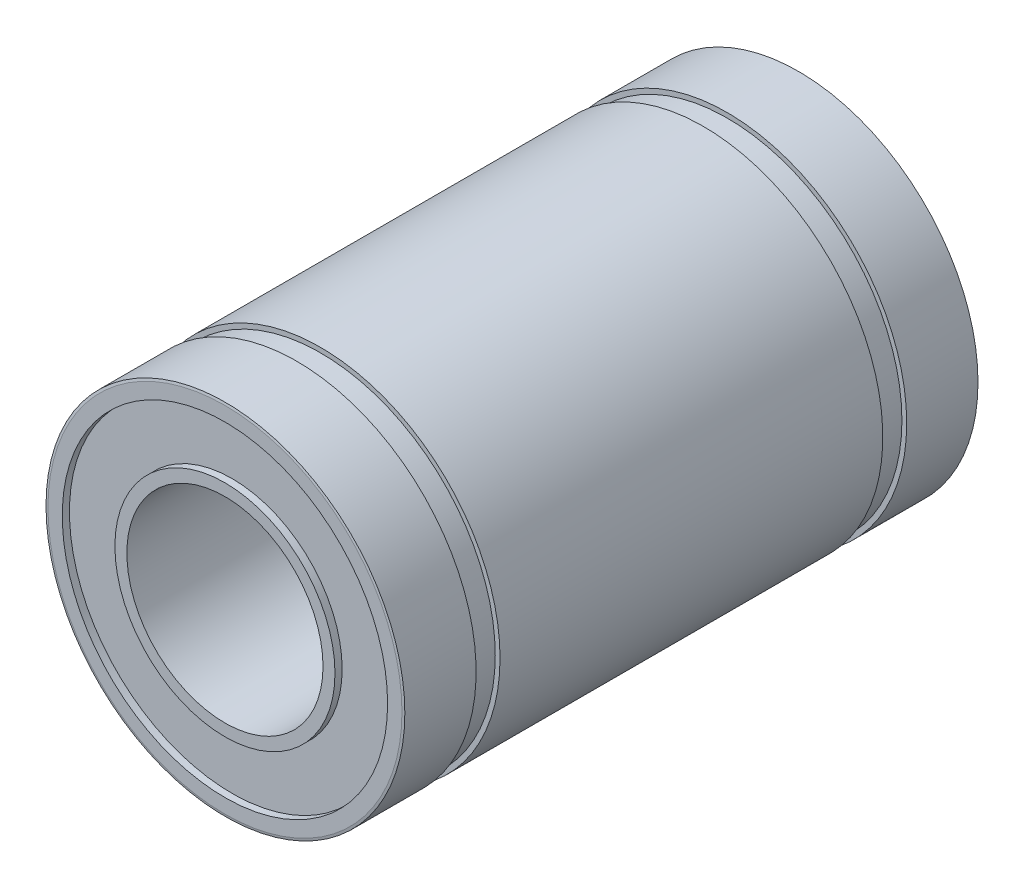
ISO-10303-21;
HEADER;
FILE_DESCRIPTION(('STEP AP214'),'2;1');
FILE_NAME('part.step','',(''),(''),'','','');
FILE_SCHEMA(('AUTOMOTIVE_DESIGN { 1 0 10303 214 1 1 1 1 }'));
ENDSEC;
DATA;
#1=APPLICATION_CONTEXT('core data for automotive mechanical design processes');
#2=APPLICATION_PROTOCOL_DEFINITION('international standard','automotive_design',2000,#1);
#3=PRODUCT_CONTEXT('',#1,'mechanical');
#4=PRODUCT('Part','Part','',(#3));
#5=PRODUCT_RELATED_PRODUCT_CATEGORY('part','',(#4));
#6=PRODUCT_DEFINITION_FORMATION('','',#4);
#7=PRODUCT_DEFINITION_CONTEXT('part definition',#1,'design');
#8=PRODUCT_DEFINITION('design','',#6,#7);
#9=PRODUCT_DEFINITION_SHAPE('','',#8);
#10=(LENGTH_UNIT() NAMED_UNIT(*) SI_UNIT(.MILLI.,.METRE.));
#11=(NAMED_UNIT(*) PLANE_ANGLE_UNIT() SI_UNIT($,.RADIAN.));
#12=(NAMED_UNIT(*) SI_UNIT($,.STERADIAN.) SOLID_ANGLE_UNIT());
#13=UNCERTAINTY_MEASURE_WITH_UNIT(LENGTH_MEASURE(1.E-05),#10,'distance_accuracy_value','');
#14=(GEOMETRIC_REPRESENTATION_CONTEXT(3) GLOBAL_UNCERTAINTY_ASSIGNED_CONTEXT((#13)) GLOBAL_UNIT_ASSIGNED_CONTEXT((#10,
#11,#12)) REPRESENTATION_CONTEXT('',''));
#15=CARTESIAN_POINT('',(0.,0.,0.));
#16=DIRECTION('',(0.,0.,1.));
#17=DIRECTION('',(1.,0.,0.));
#18=AXIS2_PLACEMENT_3D('',#15,#16,#17);
#19=CARTESIAN_POINT('',(0.,0.,24.));
#20=DIRECTION('',(0.,0.,-1.));
#21=DIRECTION('',(-1.,0.,0.));
#22=AXIS2_PLACEMENT_3D('',#19,#20,#21);
#23=CYLINDRICAL_SURFACE('',#22,7.5);
#24=CARTESIAN_POINT('',(0.,0.,23.98));
#25=DIRECTION('',(0.,0.,1.));
#26=DIRECTION('',(1.,0.,0.));
#27=AXIS2_PLACEMENT_3D('',#24,#25,#26);
#28=CIRCLE('',#27,7.5);
#29=CARTESIAN_POINT('',(7.5,0.,23.98));
#30=VERTEX_POINT('',#29);
#31=EDGE_CURVE('E73',#30,#30,#28,.T.);
#32=ORIENTED_EDGE('',*,*,#31,.F.);
#33=EDGE_LOOP('',(#32));
#34=FACE_BOUND('',#33,.T.);
#35=CARTESIAN_POINT('',(0.,0.,21.));
#36=DIRECTION('',(0.,0.,-1.));
#37=DIRECTION('',(-1.,0.,0.));
#38=AXIS2_PLACEMENT_3D('',#35,#36,#37);
#39=CIRCLE('',#38,7.5);
#40=CARTESIAN_POINT('',(-7.5,0.,21.));
#41=VERTEX_POINT('',#40);
#42=EDGE_CURVE('E19',#41,#41,#39,.T.);
#43=ORIENTED_EDGE('',*,*,#42,.F.);
#44=EDGE_LOOP('',(#43));
#45=FACE_BOUND('',#44,.T.);
#46=ADVANCED_FACE('F15',(#34,#45),#23,.T.);
#47=CARTESIAN_POINT('',(0.,0.,4.));
#48=DIRECTION('',(0.,0.,-1.));
#49=DIRECTION('',(-1.,0.,0.));
#50=AXIS2_PLACEMENT_3D('',#47,#48,#49);
#51=CIRCLE('',#50,7.5);
#52=CARTESIAN_POINT('',(-7.5,0.,4.));
#53=VERTEX_POINT('',#52);
#54=EDGE_CURVE('E33',#53,#53,#51,.T.);
#55=ORIENTED_EDGE('',*,*,#54,.F.);
#56=EDGE_LOOP('',(#55));
#57=FACE_BOUND('',#56,.T.);
#58=CARTESIAN_POINT('',(0.,0.,20.));
#59=DIRECTION('',(0.,0.,1.));
#60=DIRECTION('',(1.,0.,0.));
#61=AXIS2_PLACEMENT_3D('',#58,#59,#60);
#62=CIRCLE('',#61,7.5);
#63=CARTESIAN_POINT('',(7.5,0.,20.));
#64=VERTEX_POINT('',#63);
#65=EDGE_CURVE('E40',#64,#64,#62,.T.);
#66=ORIENTED_EDGE('',*,*,#65,.F.);
#67=EDGE_LOOP('',(#66));
#68=FACE_BOUND('',#67,.T.);
#69=ADVANCED_FACE('F114',(#57,#68),#23,.T.);
#70=CARTESIAN_POINT('',(0.,0.,0.0199999999999992));
#71=DIRECTION('',(0.,0.,1.));
#72=DIRECTION('',(1.,0.,0.));
#73=AXIS2_PLACEMENT_3D('',#70,#71,#72);
#74=CIRCLE('',#73,7.5);
#75=CARTESIAN_POINT('',(7.5,0.,0.0199999999999992));
#76=VERTEX_POINT('',#75);
#77=EDGE_CURVE('E28',#76,#76,#74,.T.);
#78=ORIENTED_EDGE('',*,*,#77,.T.);
#79=EDGE_LOOP('',(#78));
#80=FACE_BOUND('',#79,.T.);
#81=CARTESIAN_POINT('',(0.,0.,3.));
#82=DIRECTION('',(0.,0.,1.));
#83=DIRECTION('',(1.,0.,0.));
#84=AXIS2_PLACEMENT_3D('',#81,#82,#83);
#85=CIRCLE('',#84,7.5);
#86=CARTESIAN_POINT('',(7.5,0.,3.));
#87=VERTEX_POINT('',#86);
#88=EDGE_CURVE('E36',#87,#87,#85,.T.);
#89=ORIENTED_EDGE('',*,*,#88,.F.);
#90=EDGE_LOOP('',(#89));
#91=FACE_BOUND('',#90,.T.);
#92=ADVANCED_FACE('F17',(#80,#91),#23,.T.);
#93=CARTESIAN_POINT('',(0.,0.,24.));
#94=DIRECTION('',(0.,0.,1.));
#95=DIRECTION('',(1.,0.,0.));
#96=AXIS2_PLACEMENT_3D('',#93,#94,#95);
#97=PLANE('',#96);
#98=CARTESIAN_POINT('',(0.,0.,24.));
#99=DIRECTION('',(0.,0.,1.));
#100=DIRECTION('',(1.,0.,0.));
#101=AXIS2_PLACEMENT_3D('',#98,#99,#100);
#102=CIRCLE('',#101,4.1);
#103=CARTESIAN_POINT('',(4.1,0.,24.));
#104=VERTEX_POINT('',#103);
#105=EDGE_CURVE('E10',#104,#104,#102,.T.);
#106=ORIENTED_EDGE('',*,*,#105,.F.);
#107=EDGE_LOOP('',(#106));
#108=FACE_BOUND('',#107,.T.);
#109=CARTESIAN_POINT('',(0.,0.,24.));
#110=DIRECTION('',(0.,0.,1.));
#111=DIRECTION('',(1.,0.,0.));
#112=AXIS2_PLACEMENT_3D('',#109,#110,#111);
#113=CIRCLE('',#112,4.6);
#114=CARTESIAN_POINT('',(4.6,0.,24.));
#115=VERTEX_POINT('',#114);
#116=EDGE_CURVE('E39',#115,#115,#113,.T.);
#117=ORIENTED_EDGE('',*,*,#116,.T.);
#118=EDGE_LOOP('',(#117));
#119=FACE_BOUND('',#118,.T.);
#120=ADVANCED_FACE('F124',(#108,#119),#97,.T.);
#121=CARTESIAN_POINT('',(0.,0.,0.));
#122=DIRECTION('',(0.,0.,1.));
#123=DIRECTION('',(1.,0.,0.));
#124=AXIS2_PLACEMENT_3D('',#121,#122,#123);
#125=PLANE('',#124);
#126=CARTESIAN_POINT('',(0.,0.,0.));
#127=DIRECTION('',(0.,0.,1.));
#128=DIRECTION('',(1.,0.,0.));
#129=AXIS2_PLACEMENT_3D('',#126,#127,#128);
#130=CIRCLE('',#129,4.1);
#131=CARTESIAN_POINT('',(4.1,0.,0.));
#132=VERTEX_POINT('',#131);
#133=EDGE_CURVE('E23',#132,#132,#130,.T.);
#134=ORIENTED_EDGE('',*,*,#133,.T.);
#135=EDGE_LOOP('',(#134));
#136=FACE_BOUND('',#135,.T.);
#137=CARTESIAN_POINT('',(0.,0.,0.));
#138=DIRECTION('',(0.,0.,1.));
#139=DIRECTION('',(1.,0.,0.));
#140=AXIS2_PLACEMENT_3D('',#137,#138,#139);
#141=CIRCLE('',#140,4.6);
#142=CARTESIAN_POINT('',(4.6,0.,0.));
#143=VERTEX_POINT('',#142);
#144=EDGE_CURVE('E76',#143,#143,#141,.T.);
#145=ORIENTED_EDGE('',*,*,#144,.F.);
#146=EDGE_LOOP('',(#145));
#147=FACE_BOUND('',#146,.T.);
#148=ADVANCED_FACE('F111',(#136,#147),#125,.F.);
#149=CARTESIAN_POINT('',(0.,0.,24.));
#150=DIRECTION('',(0.,0.,-1.));
#151=DIRECTION('',(-1.,0.,0.));
#152=AXIS2_PLACEMENT_3D('',#149,#150,#151);
#153=CYLINDRICAL_SURFACE('',#152,4.1);
#154=ORIENTED_EDGE('',*,*,#105,.T.);
#155=EDGE_LOOP('',(#154));
#156=FACE_BOUND('',#155,.T.);
#157=ORIENTED_EDGE('',*,*,#133,.F.);
#158=EDGE_LOOP('',(#157));
#159=FACE_BOUND('',#158,.T.);
#160=ADVANCED_FACE('F99',(#156,#159),#153,.F.);
#161=CARTESIAN_POINT('',(0.,0.,0.0199999999999992));
#162=DIRECTION('',(0.,0.,1.));
#163=DIRECTION('',(1.,0.,0.));
#164=AXIS2_PLACEMENT_3D('',#161,#162,#163);
#165=CONICAL_SURFACE('',#164,7.5,1.37340076694502);
#166=CARTESIAN_POINT('',(0.,0.,0.));
#167=DIRECTION('',(0.,0.,1.));
#168=DIRECTION('',(1.,0.,0.));
#169=AXIS2_PLACEMENT_3D('',#166,#167,#168);
#170=CIRCLE('',#169,7.4);
#171=CARTESIAN_POINT('',(7.4,0.,0.));
#172=VERTEX_POINT('',#171);
#173=EDGE_CURVE('E87',#172,#172,#170,.T.);
#174=ORIENTED_EDGE('',*,*,#173,.T.);
#175=EDGE_LOOP('',(#174));
#176=FACE_BOUND('',#175,.T.);
#177=ORIENTED_EDGE('',*,*,#77,.F.);
#178=EDGE_LOOP('',(#177));
#179=FACE_BOUND('',#178,.T.);
#180=ADVANCED_FACE('F96',(#176,#179),#165,.T.);
#181=CARTESIAN_POINT('',(0.,0.,24.));
#182=DIRECTION('',(0.,0.,1.));
#183=DIRECTION('',(1.,0.,0.));
#184=AXIS2_PLACEMENT_3D('',#181,#182,#183);
#185=CYLINDRICAL_SURFACE('',#184,6.8);
#186=CARTESIAN_POINT('',(0.,0.,0.3));
#187=DIRECTION('',(0.,0.,1.));
#188=DIRECTION('',(1.,0.,0.));
#189=AXIS2_PLACEMENT_3D('',#186,#187,#188);
#190=CIRCLE('',#189,6.8);
#191=CARTESIAN_POINT('',(6.8,0.,0.3));
#192=VERTEX_POINT('',#191);
#193=EDGE_CURVE('E82',#192,#192,#190,.T.);
#194=ORIENTED_EDGE('',*,*,#193,.T.);
#195=EDGE_LOOP('',(#194));
#196=FACE_BOUND('',#195,.T.);
#197=CARTESIAN_POINT('',(0.,0.,0.));
#198=DIRECTION('',(0.,0.,1.));
#199=DIRECTION('',(1.,0.,0.));
#200=AXIS2_PLACEMENT_3D('',#197,#198,#199);
#201=CIRCLE('',#200,6.8);
#202=CARTESIAN_POINT('',(6.8,0.,0.));
#203=VERTEX_POINT('',#202);
#204=EDGE_CURVE('E85',#203,#203,#201,.T.);
#205=ORIENTED_EDGE('',*,*,#204,.F.);
#206=EDGE_LOOP('',(#205));
#207=FACE_BOUND('',#206,.T.);
#208=ADVANCED_FACE('F98',(#196,#207),#185,.F.);
#209=CARTESIAN_POINT('',(-6.8,0.,0.3));
#210=DIRECTION('',(0.,0.,-1.));
#211=DIRECTION('',(-1.,0.,0.));
#212=AXIS2_PLACEMENT_3D('',#209,#210,#211);
#213=PLANE('',#212);
#214=CARTESIAN_POINT('',(0.,0.,0.3));
#215=DIRECTION('',(0.,0.,1.));
#216=DIRECTION('',(1.,0.,0.));
#217=AXIS2_PLACEMENT_3D('',#214,#215,#216);
#218=CIRCLE('',#217,4.6);
#219=CARTESIAN_POINT('',(4.6,0.,0.3));
#220=VERTEX_POINT('',#219);
#221=EDGE_CURVE('E79',#220,#220,#218,.T.);
#222=ORIENTED_EDGE('',*,*,#221,.T.);
#223=EDGE_LOOP('',(#222));
#224=FACE_BOUND('',#223,.T.);
#225=ORIENTED_EDGE('',*,*,#193,.F.);
#226=EDGE_LOOP('',(#225));
#227=FACE_BOUND('',#226,.T.);
#228=ADVANCED_FACE('F107',(#224,#227),#213,.T.);
#229=CARTESIAN_POINT('',(0.,0.,24.));
#230=DIRECTION('',(0.,0.,1.));
#231=DIRECTION('',(1.,0.,0.));
#232=AXIS2_PLACEMENT_3D('',#229,#230,#231);
#233=CYLINDRICAL_SURFACE('',#232,4.6);
#234=ORIENTED_EDGE('',*,*,#144,.T.);
#235=EDGE_LOOP('',(#234));
#236=FACE_BOUND('',#235,.T.);
#237=ORIENTED_EDGE('',*,*,#221,.F.);
#238=EDGE_LOOP('',(#237));
#239=FACE_BOUND('',#238,.T.);
#240=ADVANCED_FACE('F178',(#236,#239),#233,.T.);
#241=ORIENTED_EDGE('',*,*,#204,.T.);
#242=EDGE_LOOP('',(#241));
#243=FACE_BOUND('',#242,.T.);
#244=ORIENTED_EDGE('',*,*,#173,.F.);
#245=EDGE_LOOP('',(#244));
#246=FACE_BOUND('',#245,.T.);
#247=ADVANCED_FACE('F138',(#243,#246),#125,.F.);
#248=CARTESIAN_POINT('',(0.,0.,24.));
#249=DIRECTION('',(0.,0.,1.));
#250=DIRECTION('',(1.,0.,0.));
#251=AXIS2_PLACEMENT_3D('',#248,#249,#250);
#252=CYLINDRICAL_SURFACE('',#251,6.8);
#253=CARTESIAN_POINT('',(0.,0.,24.));
#254=DIRECTION('',(0.,0.,1.));
#255=DIRECTION('',(1.,0.,0.));
#256=AXIS2_PLACEMENT_3D('',#253,#254,#255);
#257=CIRCLE('',#256,6.8);
#258=CARTESIAN_POINT('',(6.8,0.,24.));
#259=VERTEX_POINT('',#258);
#260=EDGE_CURVE('E67',#259,#259,#257,.T.);
#261=ORIENTED_EDGE('',*,*,#260,.T.);
#262=EDGE_LOOP('',(#261));
#263=FACE_BOUND('',#262,.T.);
#264=CARTESIAN_POINT('',(0.,0.,23.7));
#265=DIRECTION('',(0.,0.,1.));
#266=DIRECTION('',(1.,0.,0.));
#267=AXIS2_PLACEMENT_3D('',#264,#265,#266);
#268=CIRCLE('',#267,6.8);
#269=CARTESIAN_POINT('',(6.8,0.,23.7));
#270=VERTEX_POINT('',#269);
#271=EDGE_CURVE('E64',#270,#270,#268,.T.);
#272=ORIENTED_EDGE('',*,*,#271,.F.);
#273=EDGE_LOOP('',(#272));
#274=FACE_BOUND('',#273,.T.);
#275=ADVANCED_FACE('F161',(#263,#274),#252,.F.);
#276=CARTESIAN_POINT('',(-6.8,0.,23.7));
#277=DIRECTION('',(0.,0.,1.));
#278=DIRECTION('',(1.,0.,0.));
#279=AXIS2_PLACEMENT_3D('',#276,#277,#278);
#280=PLANE('',#279);
#281=ORIENTED_EDGE('',*,*,#271,.T.);
#282=EDGE_LOOP('',(#281));
#283=FACE_BOUND('',#282,.T.);
#284=CARTESIAN_POINT('',(0.,0.,23.7));
#285=DIRECTION('',(0.,0.,1.));
#286=DIRECTION('',(1.,0.,0.));
#287=AXIS2_PLACEMENT_3D('',#284,#285,#286);
#288=CIRCLE('',#287,4.6);
#289=CARTESIAN_POINT('',(4.6,0.,23.7));
#290=VERTEX_POINT('',#289);
#291=EDGE_CURVE('E61',#290,#290,#288,.T.);
#292=ORIENTED_EDGE('',*,*,#291,.F.);
#293=EDGE_LOOP('',(#292));
#294=FACE_BOUND('',#293,.T.);
#295=ADVANCED_FACE('F153',(#283,#294),#280,.T.);
#296=CARTESIAN_POINT('',(0.,0.,24.));
#297=DIRECTION('',(0.,0.,1.));
#298=DIRECTION('',(1.,0.,0.));
#299=AXIS2_PLACEMENT_3D('',#296,#297,#298);
#300=CYLINDRICAL_SURFACE('',#299,4.6);
#301=ORIENTED_EDGE('',*,*,#291,.T.);
#302=EDGE_LOOP('',(#301));
#303=FACE_BOUND('',#302,.T.);
#304=ORIENTED_EDGE('',*,*,#116,.F.);
#305=EDGE_LOOP('',(#304));
#306=FACE_BOUND('',#305,.T.);
#307=ADVANCED_FACE('F142',(#303,#306),#300,.T.);
#308=ORIENTED_EDGE('',*,*,#260,.F.);
#309=EDGE_LOOP('',(#308));
#310=FACE_BOUND('',#309,.T.);
#311=CARTESIAN_POINT('',(0.,0.,24.));
#312=DIRECTION('',(0.,0.,1.));
#313=DIRECTION('',(1.,0.,0.));
#314=AXIS2_PLACEMENT_3D('',#311,#312,#313);
#315=CIRCLE('',#314,7.4);
#316=CARTESIAN_POINT('',(7.4,0.,24.));
#317=VERTEX_POINT('',#316);
#318=EDGE_CURVE('E70',#317,#317,#315,.T.);
#319=ORIENTED_EDGE('',*,*,#318,.T.);
#320=EDGE_LOOP('',(#319));
#321=FACE_BOUND('',#320,.T.);
#322=ADVANCED_FACE('F132',(#310,#321),#97,.T.);
#323=CARTESIAN_POINT('',(0.,0.,24.));
#324=DIRECTION('',(0.,0.,-1.));
#325=DIRECTION('',(-1.,0.,0.));
#326=AXIS2_PLACEMENT_3D('',#323,#324,#325);
#327=CONICAL_SURFACE('',#326,7.4,1.37340076694502);
#328=ORIENTED_EDGE('',*,*,#31,.T.);
#329=EDGE_LOOP('',(#328));
#330=FACE_BOUND('',#329,.T.);
#331=ORIENTED_EDGE('',*,*,#318,.F.);
#332=EDGE_LOOP('',(#331));
#333=FACE_BOUND('',#332,.T.);
#334=ADVANCED_FACE('F141',(#330,#333),#327,.T.);
#335=CARTESIAN_POINT('',(-7.7,0.,3.));
#336=DIRECTION('',(0.,0.,1.));
#337=DIRECTION('',(1.,0.,0.));
#338=AXIS2_PLACEMENT_3D('',#335,#336,#337);
#339=PLANE('',#338);
#340=CARTESIAN_POINT('',(0.,0.,3.));
#341=DIRECTION('',(0.,0.,1.));
#342=DIRECTION('',(1.,0.,0.));
#343=AXIS2_PLACEMENT_3D('',#340,#341,#342);
#344=CIRCLE('',#343,7.3);
#345=CARTESIAN_POINT('',(7.3,0.,3.));
#346=VERTEX_POINT('',#345);
#347=EDGE_CURVE('E37',#346,#346,#344,.T.);
#348=ORIENTED_EDGE('',*,*,#347,.F.);
#349=EDGE_LOOP('',(#348));
#350=FACE_BOUND('',#349,.T.);
#351=ORIENTED_EDGE('',*,*,#88,.T.);
#352=EDGE_LOOP('',(#351));
#353=FACE_BOUND('',#352,.T.);
#354=ADVANCED_FACE('F149',(#350,#353),#339,.T.);
#355=CARTESIAN_POINT('',(-7.7,0.,4.));
#356=DIRECTION('',(0.,0.,-1.));
#357=DIRECTION('',(-1.,0.,0.));
#358=AXIS2_PLACEMENT_3D('',#355,#356,#357);
#359=PLANE('',#358);
#360=CARTESIAN_POINT('',(0.,0.,4.));
#361=DIRECTION('',(0.,0.,1.));
#362=DIRECTION('',(1.,0.,0.));
#363=AXIS2_PLACEMENT_3D('',#360,#361,#362);
#364=CIRCLE('',#363,7.3);
#365=CARTESIAN_POINT('',(7.3,0.,4.));
#366=VERTEX_POINT('',#365);
#367=EDGE_CURVE('E46',#366,#366,#364,.T.);
#368=ORIENTED_EDGE('',*,*,#367,.T.);
#369=EDGE_LOOP('',(#368));
#370=FACE_BOUND('',#369,.T.);
#371=ORIENTED_EDGE('',*,*,#54,.T.);
#372=EDGE_LOOP('',(#371));
#373=FACE_BOUND('',#372,.T.);
#374=ADVANCED_FACE('F228',(#370,#373),#359,.T.);
#375=CARTESIAN_POINT('',(0.,0.,24.));
#376=DIRECTION('',(0.,0.,1.));
#377=DIRECTION('',(1.,0.,0.));
#378=AXIS2_PLACEMENT_3D('',#375,#376,#377);
#379=CYLINDRICAL_SURFACE('',#378,7.3);
#380=ORIENTED_EDGE('',*,*,#347,.T.);
#381=EDGE_LOOP('',(#380));
#382=FACE_BOUND('',#381,.T.);
#383=ORIENTED_EDGE('',*,*,#367,.F.);
#384=EDGE_LOOP('',(#383));
#385=FACE_BOUND('',#384,.T.);
#386=ADVANCED_FACE('F223',(#382,#385),#379,.T.);
#387=CARTESIAN_POINT('',(-7.7,0.,21.));
#388=DIRECTION('',(0.,0.,-1.));
#389=DIRECTION('',(-1.,0.,0.));
#390=AXIS2_PLACEMENT_3D('',#387,#388,#389);
#391=PLANE('',#390);
#392=CARTESIAN_POINT('',(0.,0.,21.));
#393=DIRECTION('',(0.,0.,1.));
#394=DIRECTION('',(1.,0.,0.));
#395=AXIS2_PLACEMENT_3D('',#392,#393,#394);
#396=CIRCLE('',#395,7.3);
#397=CARTESIAN_POINT('',(7.3,0.,21.));
#398=VERTEX_POINT('',#397);
#399=EDGE_CURVE('E42',#398,#398,#396,.T.);
#400=ORIENTED_EDGE('',*,*,#399,.T.);
#401=EDGE_LOOP('',(#400));
#402=FACE_BOUND('',#401,.T.);
#403=ORIENTED_EDGE('',*,*,#42,.T.);
#404=EDGE_LOOP('',(#403));
#405=FACE_BOUND('',#404,.T.);
#406=ADVANCED_FACE('F227',(#402,#405),#391,.T.);
#407=CARTESIAN_POINT('',(-7.7,0.,20.));
#408=DIRECTION('',(0.,0.,1.));
#409=DIRECTION('',(1.,0.,0.));
#410=AXIS2_PLACEMENT_3D('',#407,#408,#409);
#411=PLANE('',#410);
#412=CARTESIAN_POINT('',(0.,0.,20.));
#413=DIRECTION('',(0.,0.,1.));
#414=DIRECTION('',(1.,0.,0.));
#415=AXIS2_PLACEMENT_3D('',#412,#413,#414);
#416=CIRCLE('',#415,7.3);
#417=CARTESIAN_POINT('',(7.3,0.,20.));
#418=VERTEX_POINT('',#417);
#419=EDGE_CURVE('E48',#418,#418,#416,.T.);
#420=ORIENTED_EDGE('',*,*,#419,.F.);
#421=EDGE_LOOP('',(#420));
#422=FACE_BOUND('',#421,.T.);
#423=ORIENTED_EDGE('',*,*,#65,.T.);
#424=EDGE_LOOP('',(#423));
#425=FACE_BOUND('',#424,.T.);
#426=ADVANCED_FACE('F238',(#422,#425),#411,.T.);
#427=CARTESIAN_POINT('',(0.,0.,24.));
#428=DIRECTION('',(0.,0.,1.));
#429=DIRECTION('',(1.,0.,0.));
#430=AXIS2_PLACEMENT_3D('',#427,#428,#429);
#431=CYLINDRICAL_SURFACE('',#430,7.3);
#432=ORIENTED_EDGE('',*,*,#419,.T.);
#433=EDGE_LOOP('',(#432));
#434=FACE_BOUND('',#433,.T.);
#435=ORIENTED_EDGE('',*,*,#399,.F.);
#436=EDGE_LOOP('',(#435));
#437=FACE_BOUND('',#436,.T.);
#438=ADVANCED_FACE('F235',(#434,#437),#431,.T.);
#439=CLOSED_SHELL('',(#46,#69,#92,#120,#148,#160,#180,#208,#228,#240,#247,#275,#295,#307,#322,
#334,#354,#374,#386,#406,#426,#438));
#440=MANIFOLD_SOLID_BREP('B1',#439);
#441=ADVANCED_BREP_SHAPE_REPRESENTATION('',(#18,#440),#14);
#442=SHAPE_DEFINITION_REPRESENTATION(#9,#441);
ENDSEC;
END-ISO-10303-21;
